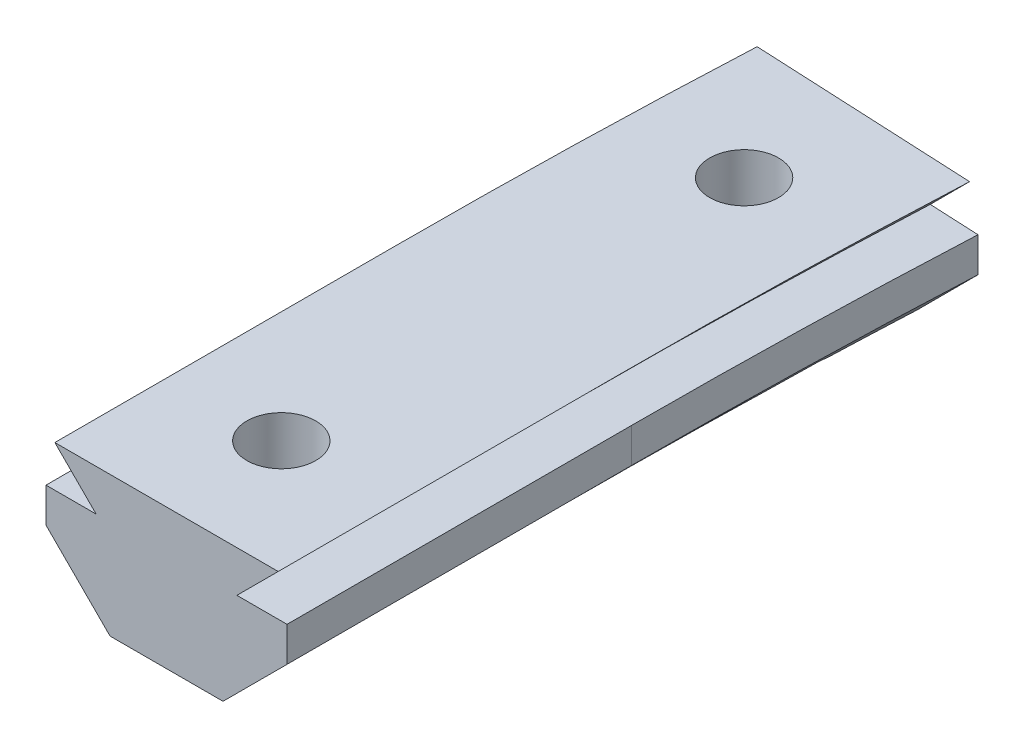
ISO-10303-21;
HEADER;
FILE_DESCRIPTION(('STEP AP214'),'2;1');
FILE_NAME('part.step','',(''),(''),'','','');
FILE_SCHEMA(('AUTOMOTIVE_DESIGN { 1 0 10303 214 1 1 1 1 }'));
ENDSEC;
DATA;
#1=APPLICATION_CONTEXT('core data for automotive mechanical design processes');
#2=APPLICATION_PROTOCOL_DEFINITION('international standard','automotive_design',2000,#1);
#3=PRODUCT_CONTEXT('',#1,'mechanical');
#4=PRODUCT('Part','Part','',(#3));
#5=PRODUCT_RELATED_PRODUCT_CATEGORY('part','',(#4));
#6=PRODUCT_DEFINITION_FORMATION('','',#4);
#7=PRODUCT_DEFINITION_CONTEXT('part definition',#1,'design');
#8=PRODUCT_DEFINITION('design','',#6,#7);
#9=PRODUCT_DEFINITION_SHAPE('','',#8);
#10=(LENGTH_UNIT() NAMED_UNIT(*) SI_UNIT(.MILLI.,.METRE.));
#11=(NAMED_UNIT(*) PLANE_ANGLE_UNIT() SI_UNIT($,.RADIAN.));
#12=(NAMED_UNIT(*) SI_UNIT($,.STERADIAN.) SOLID_ANGLE_UNIT());
#13=UNCERTAINTY_MEASURE_WITH_UNIT(LENGTH_MEASURE(1.E-05),#10,'distance_accuracy_value','');
#14=(GEOMETRIC_REPRESENTATION_CONTEXT(3) GLOBAL_UNCERTAINTY_ASSIGNED_CONTEXT((#13)) GLOBAL_UNIT_ASSIGNED_CONTEXT((#10,
#11,#12)) REPRESENTATION_CONTEXT('',''));
#15=CARTESIAN_POINT('',(0.,0.,0.));
#16=DIRECTION('',(0.,0.,1.));
#17=DIRECTION('',(1.,0.,0.));
#18=AXIS2_PLACEMENT_3D('',#15,#16,#17);
#19=CARTESIAN_POINT('',(0.,-6.69603261727048E-13,10.));
#20=DIRECTION('',(0.,1.,0.));
#21=DIRECTION('',(-1.,0.,0.));
#22=AXIS2_PLACEMENT_3D('',#19,#20,#21);
#23=CYLINDRICAL_SURFACE('',#22,1.5);
#24=CARTESIAN_POINT('',(0.,6.1,10.));
#25=DIRECTION('',(0.,1.,0.));
#26=DIRECTION('',(-1.,0.,0.));
#27=AXIS2_PLACEMENT_3D('',#24,#25,#26);
#28=CIRCLE('',#27,1.5);
#29=CARTESIAN_POINT('',(-1.49999999999999,6.1,10.));
#30=VERTEX_POINT('',#29);
#31=EDGE_CURVE('E535',#30,#30,#28,.T.);
#32=ORIENTED_EDGE('',*,*,#31,.T.);
#33=EDGE_LOOP('',(#32));
#34=FACE_BOUND('',#33,.T.);
#35=CARTESIAN_POINT('',(0.,3.,10.));
#36=DIRECTION('',(0.,-1.,0.));
#37=DIRECTION('',(1.,0.,0.));
#38=AXIS2_PLACEMENT_3D('',#35,#36,#37);
#39=CIRCLE('',#38,1.5);
#40=CARTESIAN_POINT('',(1.5,3.,10.));
#41=VERTEX_POINT('',#40);
#42=EDGE_CURVE('E42',#41,#41,#39,.F.);
#43=ORIENTED_EDGE('',*,*,#42,.F.);
#44=EDGE_LOOP('',(#43));
#45=FACE_BOUND('',#44,.T.);
#46=ADVANCED_FACE('F38',(#34,#45),#23,.F.);
#47=CARTESIAN_POINT('',(0.159022715777613,-6.69603261727048E-13,-10.));
#48=DIRECTION('',(0.,1.,0.));
#49=DIRECTION('',(-1.,0.,0.));
#50=AXIS2_PLACEMENT_3D('',#47,#48,#49);
#51=CYLINDRICAL_SURFACE('',#50,1.5);
#52=CARTESIAN_POINT('',(0.159022715777619,6.1,-10.));
#53=DIRECTION('',(0.,1.,0.));
#54=DIRECTION('',(-1.,0.,0.));
#55=AXIS2_PLACEMENT_3D('',#52,#53,#54);
#56=CIRCLE('',#55,1.5);
#57=CARTESIAN_POINT('',(-1.34097728422238,6.1,-10.));
#58=VERTEX_POINT('',#57);
#59=EDGE_CURVE('E531',#58,#58,#56,.T.);
#60=ORIENTED_EDGE('',*,*,#59,.T.);
#61=EDGE_LOOP('',(#60));
#62=FACE_BOUND('',#61,.T.);
#63=CARTESIAN_POINT('',(0.159022715777616,3.,-10.));
#64=DIRECTION('',(0.,-1.,0.));
#65=DIRECTION('',(1.,0.,0.));
#66=AXIS2_PLACEMENT_3D('',#63,#64,#65);
#67=CIRCLE('',#66,1.5);
#68=CARTESIAN_POINT('',(1.65902271577762,3.,-10.));
#69=VERTEX_POINT('',#68);
#70=EDGE_CURVE('E426',#69,#69,#67,.F.);
#71=ORIENTED_EDGE('',*,*,#70,.F.);
#72=EDGE_LOOP('',(#71));
#73=FACE_BOUND('',#72,.T.);
#74=ADVANCED_FACE('F629',(#62,#73),#51,.F.);
#75=CARTESIAN_POINT('',(-2.46065352773282,0.,0.));
#76=DIRECTION('',(0.,1.,0.));
#77=DIRECTION('',(-1.,0.,0.));
#78=AXIS2_PLACEMENT_3D('',#75,#76,#77);
#79=PLANE('',#78);
#80=CARTESIAN_POINT('',(314.5,-3.30031141304588E-13,0.));
#81=DIRECTION('',(0.,-1.,0.));
#82=DIRECTION('',(-1.,0.,0.));
#83=AXIS2_PLACEMENT_3D('',#80,#81,#82);
#84=CIRCLE('',#83,316.960653527733);
#85=CARTESIAN_POINT('',(-2.46065352773283,0.,0.));
#86=VERTEX_POINT('',#85);
#87=CARTESIAN_POINT('',(-2.3404288469579,0.,-8.72917709771534));
#88=VERTEX_POINT('',#87);
#89=EDGE_CURVE('E609',#86,#88,#84,.T.);
#90=ORIENTED_EDGE('',*,*,#89,.T.);
#91=DIRECTION('',(-0.5,0.,-0.866025403784439));
#92=VECTOR('',#91,1.);
#93=CARTESIAN_POINT('',(-1.45755803795334,0.,-7.2));
#94=LINE('',#93,#92);
#95=CARTESIAN_POINT('',(-1.45755803795334,0.,-7.2));
#96=VERTEX_POINT('',#95);
#97=EDGE_CURVE('E290',#96,#88,#94,.T.);
#98=ORIENTED_EDGE('',*,*,#97,.F.);
#99=DIRECTION('',(-1.,0.,0.));
#100=VECTOR('',#99,1.);
#101=CARTESIAN_POINT('',(1.77560346950857,0.,-7.2));
#102=LINE('',#101,#100);
#103=CARTESIAN_POINT('',(1.77560346950857,0.,-7.2));
#104=VERTEX_POINT('',#103);
#105=EDGE_CURVE('E272',#104,#96,#102,.T.);
#106=ORIENTED_EDGE('',*,*,#105,.F.);
#107=DIRECTION('',(0.5,0.,-0.866025403784439));
#108=VECTOR('',#107,1.);
#109=CARTESIAN_POINT('',(-2.40115223342576,0.,0.0343530882853131));
#110=LINE('',#109,#108);
#111=CARTESIAN_POINT('',(2.57895080141731,0.,-8.59143839499084));
#112=VERTEX_POINT('',#111);
#113=EDGE_CURVE('E11',#104,#112,#110,.T.);
#114=ORIENTED_EDGE('',*,*,#113,.T.);
#115=CARTESIAN_POINT('',(314.5,-3.23959609138669E-13,0.));
#116=DIRECTION('',(0.,-1.,0.));
#117=DIRECTION('',(-1.,0.,0.));
#118=AXIS2_PLACEMENT_3D('',#115,#116,#117);
#119=CIRCLE('',#118,312.039346472267);
#120=CARTESIAN_POINT('',(2.46065352773283,0.,0.));
#121=VERTEX_POINT('',#120);
#122=EDGE_CURVE('E438',#121,#112,#119,.T.);
#123=ORIENTED_EDGE('',*,*,#122,.F.);
#124=DIRECTION('',(0.,0.,-1.));
#125=VECTOR('',#124,1.);
#126=CARTESIAN_POINT('',(2.46065352773283,0.,15.));
#127=LINE('',#126,#125);
#128=CARTESIAN_POINT('',(2.46065352773282,0.,8.66197692985684));
#129=VERTEX_POINT('',#128);
#130=EDGE_CURVE('E495',#129,#121,#127,.T.);
#131=ORIENTED_EDGE('',*,*,#130,.F.);
#132=DIRECTION('',(0.5,0.,0.866025403784439));
#133=VECTOR('',#132,1.);
#134=CARTESIAN_POINT('',(1.61658075373095,0.,7.2));
#135=LINE('',#134,#133);
#136=CARTESIAN_POINT('',(1.61658075373095,0.,7.2));
#137=VERTEX_POINT('',#136);
#138=EDGE_CURVE('E349',#137,#129,#135,.T.);
#139=ORIENTED_EDGE('',*,*,#138,.F.);
#140=DIRECTION('',(1.,0.,0.));
#141=VECTOR('',#140,1.);
#142=CARTESIAN_POINT('',(-1.61658075373095,0.,7.2));
#143=LINE('',#142,#141);
#144=CARTESIAN_POINT('',(-1.61658075373095,0.,7.2));
#145=VERTEX_POINT('',#144);
#146=EDGE_CURVE('E345',#145,#137,#143,.T.);
#147=ORIENTED_EDGE('',*,*,#146,.F.);
#148=DIRECTION('',(-0.5,0.,0.866025403784439));
#149=VECTOR('',#148,1.);
#150=CARTESIAN_POINT('',(1.29009250639256,0.,2.16549423246421));
#151=LINE('',#150,#149);
#152=CARTESIAN_POINT('',(-2.46065352773283,0.,8.66197692985686));
#153=VERTEX_POINT('',#152);
#154=EDGE_CURVE('E539',#145,#153,#151,.T.);
#155=ORIENTED_EDGE('',*,*,#154,.T.);
#156=DIRECTION('',(0.,0.,-1.));
#157=VECTOR('',#156,1.);
#158=CARTESIAN_POINT('',(-2.46065352773282,0.,15.));
#159=LINE('',#158,#157);
#160=EDGE_CURVE('E490',#153,#86,#159,.T.);
#161=ORIENTED_EDGE('',*,*,#160,.T.);
#162=EDGE_LOOP('',(#90,#98,#106,#114,#123,#131,#139,#147,#155,#161));
#163=FACE_BOUND('',#162,.T.);
#164=ADVANCED_FACE('F636',(#163),#79,.F.);
#165=CARTESIAN_POINT('',(-2.46065352773282,0.,15.));
#166=VERTEX_POINT('',#165);
#167=CARTESIAN_POINT('',(-2.46065352773284,0.,11.3380230701431));
#168=VERTEX_POINT('',#167);
#169=EDGE_CURVE('E491',#166,#168,#159,.T.);
#170=ORIENTED_EDGE('',*,*,#169,.T.);
#171=DIRECTION('',(-0.5,0.,-0.866025403784439));
#172=VECTOR('',#171,1.);
#173=CARTESIAN_POINT('',(-1.61658075373095,0.,12.8));
#174=LINE('',#173,#172);
#175=CARTESIAN_POINT('',(-1.61658075373095,0.,12.8));
#176=VERTEX_POINT('',#175);
#177=EDGE_CURVE('E342',#176,#168,#174,.T.);
#178=ORIENTED_EDGE('',*,*,#177,.F.);
#179=DIRECTION('',(-1.,0.,0.));
#180=VECTOR('',#179,1.);
#181=CARTESIAN_POINT('',(1.61658075373095,0.,12.8));
#182=LINE('',#181,#180);
#183=CARTESIAN_POINT('',(1.61658075373095,0.,12.8));
#184=VERTEX_POINT('',#183);
#185=EDGE_CURVE('E321',#184,#176,#182,.T.);
#186=ORIENTED_EDGE('',*,*,#185,.F.);
#187=DIRECTION('',(0.5,0.,-0.866025403784439));
#188=VECTOR('',#187,1.);
#189=CARTESIAN_POINT('',(6.13983476758542,0.,4.96549423246421));
#190=LINE('',#189,#188);
#191=CARTESIAN_POINT('',(2.46065352773282,0.,11.3380230701432));
#192=VERTEX_POINT('',#191);
#193=EDGE_CURVE('E615',#184,#192,#190,.T.);
#194=ORIENTED_EDGE('',*,*,#193,.T.);
#195=CARTESIAN_POINT('',(2.46065352773283,0.,15.));
#196=VERTEX_POINT('',#195);
#197=EDGE_CURVE('E496',#196,#192,#127,.T.);
#198=ORIENTED_EDGE('',*,*,#197,.F.);
#199=DIRECTION('',(1.,0.,0.));
#200=VECTOR('',#199,1.);
#201=CARTESIAN_POINT('',(-2.46065352773282,0.,15.));
#202=LINE('',#201,#200);
#203=EDGE_CURVE('E500',#166,#196,#202,.T.);
#204=ORIENTED_EDGE('',*,*,#203,.F.);
#205=EDGE_LOOP('',(#170,#178,#186,#194,#198,#204));
#206=FACE_BOUND('',#205,.T.);
#207=ADVANCED_FACE('F644',(#206),#79,.F.);
#208=CARTESIAN_POINT('',(0.715059629038089,0.,-14.9791502782834));
#209=DIRECTION('',(0.0476826962324272,0.,-0.998862533324785));
#210=DIRECTION('',(-0.998862533324785,0.,-0.0476826962324272));
#211=AXIS2_PLACEMENT_3D('',#208,#209,#210);
#212=PLANE('',#211);
#213=DIRECTION('',(0.,-1.,0.));
#214=VECTOR('',#213,1.);
#215=CARTESIAN_POINT('',(5.60176156931036,2.78934647226714,-14.7458738098781));
#216=LINE('',#215,#214);
#217=CARTESIAN_POINT('',(5.60176156931036,4.3,-14.7458738098781));
#218=VERTEX_POINT('',#217);
#219=CARTESIAN_POINT('',(5.60176156931042,2.78934647226715,-14.7458738098781));
#220=VERTEX_POINT('',#219);
#221=EDGE_CURVE('E572',#218,#220,#216,.T.);
#222=ORIENTED_EDGE('',*,*,#221,.T.);
#223=DIRECTION('',(0.706302470787129,0.707106781186548,0.0337167578512075));
#224=VECTOR('',#223,1.);
#225=CARTESIAN_POINT('',(314.5,312.039346472268,0.));
#226=LINE('',#225,#224);
#227=CARTESIAN_POINT('',(2.81558788570102,0.,-14.8788773704022));
#228=VERTEX_POINT('',#227);
#229=EDGE_CURVE('E576',#220,#228,#226,.F.);
#230=ORIENTED_EDGE('',*,*,#229,.T.);
#231=DIRECTION('',(-0.998862533324785,0.,-0.0476826962324272));
#232=VECTOR('',#231,1.);
#233=CARTESIAN_POINT('',(-1.73999925958907,0.,-15.0963474133381));
#234=LINE('',#233,#232);
#235=CARTESIAN_POINT('',(-2.10012134699056,0.,-15.1135385597945));
#236=VERTEX_POINT('',#235);
#237=EDGE_CURVE('E540',#228,#236,#234,.T.);
#238=ORIENTED_EDGE('',*,*,#237,.T.);
#239=DIRECTION('',(-0.706302470787128,0.707106781186549,-0.0337167578512075));
#240=VECTOR('',#239,1.);
#241=CARTESIAN_POINT('',(314.5,-316.960653527733,0.));
#242=LINE('',#241,#240);
#243=CARTESIAN_POINT('',(-4.88629503059984,2.78934647226714,-15.2465421203186));
#244=VERTEX_POINT('',#243);
#245=EDGE_CURVE('E544',#236,#244,#242,.T.);
#246=ORIENTED_EDGE('',*,*,#245,.T.);
#247=DIRECTION('',(0.,-1.,0.));
#248=VECTOR('',#247,1.);
#249=CARTESIAN_POINT('',(-4.88629503059984,2.78934647226715,-15.2465421203186));
#250=LINE('',#249,#248);
#251=CARTESIAN_POINT('',(-4.88629503059979,4.3,-15.2465421203186));
#252=VERTEX_POINT('',#251);
#253=EDGE_CURVE('E548',#244,#252,#250,.F.);
#254=ORIENTED_EDGE('',*,*,#253,.T.);
#255=DIRECTION('',(0.998862533324785,0.,0.0476826962324272));
#256=VECTOR('',#255,1.);
#257=CARTESIAN_POINT('',(-4.52300376348194,4.3,-15.2291996867444));
#258=LINE('',#257,#256);
#259=CARTESIAN_POINT('',(-2.70378039528518,4.3,-15.1423554290507));
#260=VERTEX_POINT('',#259);
#261=EDGE_CURVE('E552',#252,#260,#258,.T.);
#262=ORIENTED_EDGE('',*,*,#261,.T.);
#263=DIRECTION('',(-0.706302470787134,0.707106781186543,-0.0337167578512078));
#264=VECTOR('',#263,1.);
#265=CARTESIAN_POINT('',(314.5,-313.264999999995,0.));
#266=LINE('',#265,#264);
#267=CARTESIAN_POINT('',(-4.50173295526979,6.1,-15.2281842822691));
#268=VERTEX_POINT('',#267);
#269=EDGE_CURVE('E556',#260,#268,#266,.T.);
#270=ORIENTED_EDGE('',*,*,#269,.T.);
#271=DIRECTION('',(0.998862533324785,0.,0.0476826962324272));
#272=VECTOR('',#271,1.);
#273=CARTESIAN_POINT('',(5.56899837277334,6.09999999999999,-14.7474378264429));
#274=LINE('',#273,#272);
#275=CARTESIAN_POINT('',(5.21719949398031,6.1,-14.7642316479276));
#276=VERTEX_POINT('',#275);
#277=EDGE_CURVE('E560',#268,#276,#274,.T.);
#278=ORIENTED_EDGE('',*,*,#277,.T.);
#279=DIRECTION('',(0.706302470787134,0.707106781186543,0.0337167578512077));
#280=VECTOR('',#279,1.);
#281=CARTESIAN_POINT('',(314.5,315.734999999996,0.));
#282=LINE('',#281,#280);
#283=CARTESIAN_POINT('',(3.4192469339957,4.3,-14.8500605011459));
#284=VERTEX_POINT('',#283);
#285=EDGE_CURVE('E564',#276,#284,#282,.F.);
#286=ORIENTED_EDGE('',*,*,#285,.T.);
#287=DIRECTION('',(0.998862533324785,0.,0.0476826962324272));
#288=VECTOR('',#287,1.);
#289=CARTESIAN_POINT('',(5.95312302155812,4.3,-14.7291008698224));
#290=LINE('',#289,#288);
#291=EDGE_CURVE('E568',#284,#218,#290,.T.);
#292=ORIENTED_EDGE('',*,*,#291,.T.);
#293=EDGE_LOOP('',(#222,#230,#238,#246,#254,#262,#270,#278,#286,#292));
#294=FACE_BOUND('',#293,.T.);
#295=ADVANCED_FACE('F641',(#294),#212,.T.);
#296=CARTESIAN_POINT('',(314.5,2.78934647226682,0.));
#297=DIRECTION('',(0.,-1.,0.));
#298=DIRECTION('',(1.,0.,0.));
#299=AXIS2_PLACEMENT_3D('',#296,#297,#298);
#300=CYLINDRICAL_SURFACE('',#299,309.25);
#301=ORIENTED_EDGE('',*,*,#221,.F.);
#302=CARTESIAN_POINT('',(314.5,4.29999999999967,0.));
#303=DIRECTION('',(0.,-1.,0.));
#304=DIRECTION('',(-1.,0.,0.));
#305=AXIS2_PLACEMENT_3D('',#302,#303,#304);
#306=CIRCLE('',#305,309.25);
#307=CARTESIAN_POINT('',(5.24999999999999,4.3,0.));
#308=VERTEX_POINT('',#307);
#309=EDGE_CURVE('E588',#308,#218,#306,.T.);
#310=ORIENTED_EDGE('',*,*,#309,.F.);
#311=DIRECTION('',(0.,1.,0.));
#312=VECTOR('',#311,1.);
#313=CARTESIAN_POINT('',(5.25,2.78934647226715,0.));
#314=LINE('',#313,#312);
#315=CARTESIAN_POINT('',(5.24999999999999,2.78934647226715,0.));
#316=VERTEX_POINT('',#315);
#317=EDGE_CURVE('E450',#316,#308,#314,.T.);
#318=ORIENTED_EDGE('',*,*,#317,.F.);
#319=CARTESIAN_POINT('',(314.5,2.78934647226682,0.));
#320=DIRECTION('',(0.,-1.,0.));
#321=DIRECTION('',(-1.,0.,0.));
#322=AXIS2_PLACEMENT_3D('',#319,#320,#321);
#323=CIRCLE('',#322,309.25);
#324=EDGE_CURVE('E585',#316,#220,#323,.T.);
#325=ORIENTED_EDGE('',*,*,#324,.T.);
#326=EDGE_LOOP('',(#301,#310,#318,#325));
#327=FACE_BOUND('',#326,.T.);
#328=ADVANCED_FACE('F643',(#327),#300,.F.);
#329=CARTESIAN_POINT('',(5.25,2.78934647226715,15.));
#330=DIRECTION('',(-1.,0.,0.));
#331=DIRECTION('',(0.,0.,1.));
#332=AXIS2_PLACEMENT_3D('',#329,#330,#331);
#333=PLANE('',#332);
#334=ORIENTED_EDGE('',*,*,#317,.T.);
#335=DIRECTION('',(0.,0.,-1.));
#336=VECTOR('',#335,1.);
#337=CARTESIAN_POINT('',(5.25,4.3,15.));
#338=LINE('',#337,#336);
#339=CARTESIAN_POINT('',(5.25,4.3,15.));
#340=VERTEX_POINT('',#339);
#341=EDGE_CURVE('E462',#340,#308,#338,.T.);
#342=ORIENTED_EDGE('',*,*,#341,.F.);
#343=DIRECTION('',(0.,1.,0.));
#344=VECTOR('',#343,1.);
#345=CARTESIAN_POINT('',(5.25,2.78934647226715,15.));
#346=LINE('',#345,#344);
#347=CARTESIAN_POINT('',(5.25,2.78934647226715,15.));
#348=VERTEX_POINT('',#347);
#349=EDGE_CURVE('E524',#348,#340,#346,.T.);
#350=ORIENTED_EDGE('',*,*,#349,.F.);
#351=DIRECTION('',(0.,0.,-1.));
#352=VECTOR('',#351,1.);
#353=CARTESIAN_POINT('',(5.25,2.78934647226715,15.));
#354=LINE('',#353,#352);
#355=EDGE_CURVE('E458',#348,#316,#354,.T.);
#356=ORIENTED_EDGE('',*,*,#355,.T.);
#357=EDGE_LOOP('',(#334,#342,#350,#356));
#358=FACE_BOUND('',#357,.T.);
#359=ADVANCED_FACE('F655',(#358),#333,.F.);
#360=CARTESIAN_POINT('',(5.25,4.3,0.));
#361=DIRECTION('',(0.,-1.,0.));
#362=DIRECTION('',(1.,0.,0.));
#363=AXIS2_PLACEMENT_3D('',#360,#361,#362);
#364=PLANE('',#363);
#365=ORIENTED_EDGE('',*,*,#291,.F.);
#366=CARTESIAN_POINT('',(314.5,4.29999999999967,0.));
#367=DIRECTION('',(0.,-1.,0.));
#368=DIRECTION('',(-1.,0.,0.));
#369=AXIS2_PLACEMENT_3D('',#366,#367,#368);
#370=CIRCLE('',#369,311.435);
#371=CARTESIAN_POINT('',(3.06499999999999,4.3,0.));
#372=VERTEX_POINT('',#371);
#373=EDGE_CURVE('E591',#372,#284,#370,.T.);
#374=ORIENTED_EDGE('',*,*,#373,.F.);
#375=DIRECTION('',(0.,0.,-1.));
#376=VECTOR('',#375,1.);
#377=CARTESIAN_POINT('',(3.065,4.3,15.));
#378=LINE('',#377,#376);
#379=CARTESIAN_POINT('',(3.065,4.3,15.));
#380=VERTEX_POINT('',#379);
#381=EDGE_CURVE('E466',#380,#372,#378,.T.);
#382=ORIENTED_EDGE('',*,*,#381,.F.);
#383=DIRECTION('',(-1.,0.,0.));
#384=VECTOR('',#383,1.);
#385=CARTESIAN_POINT('',(5.25,4.3,15.));
#386=LINE('',#385,#384);
#387=EDGE_CURVE('E521',#340,#380,#386,.T.);
#388=ORIENTED_EDGE('',*,*,#387,.F.);
#389=ORIENTED_EDGE('',*,*,#341,.T.);
#390=ORIENTED_EDGE('',*,*,#309,.T.);
#391=EDGE_LOOP('',(#365,#374,#382,#388,#389,#390));
#392=FACE_BOUND('',#391,.T.);
#393=ADVANCED_FACE('F657',(#392),#364,.F.);
#394=CARTESIAN_POINT('',(314.5,4.29999999999967,0.));
#395=DIRECTION('',(0.,-1.,0.));
#396=DIRECTION('',(1.,0.,0.));
#397=AXIS2_PLACEMENT_3D('',#394,#395,#396);
#398=CONICAL_SURFACE('',#397,311.435,0.785398163397454);
#399=ORIENTED_EDGE('',*,*,#285,.F.);
#400=CARTESIAN_POINT('',(314.5,6.09999999999968,0.));
#401=DIRECTION('',(0.,-1.,0.));
#402=DIRECTION('',(-1.,0.,0.));
#403=AXIS2_PLACEMENT_3D('',#400,#401,#402);
#404=CIRCLE('',#403,309.635);
#405=CARTESIAN_POINT('',(4.86500000000001,6.1,0.));
#406=VERTEX_POINT('',#405);
#407=EDGE_CURVE('E594',#406,#276,#404,.T.);
#408=ORIENTED_EDGE('',*,*,#407,.F.);
#409=DIRECTION('',(0.70710678118655,0.707106781186545,0.));
#410=VECTOR('',#409,1.);
#411=CARTESIAN_POINT('',(3.065,4.3,0.));
#412=LINE('',#411,#410);
#413=EDGE_CURVE('E446',#372,#406,#412,.T.);
#414=ORIENTED_EDGE('',*,*,#413,.F.);
#415=ORIENTED_EDGE('',*,*,#373,.T.);
#416=EDGE_LOOP('',(#399,#408,#414,#415));
#417=FACE_BOUND('',#416,.T.);
#418=ADVANCED_FACE('F660',(#417),#398,.F.);
#419=CARTESIAN_POINT('',(3.065,4.3,15.));
#420=DIRECTION('',(-0.707106781186545,0.70710678118655,0.));
#421=DIRECTION('',(-0.70710678118655,-0.707106781186545,0.));
#422=AXIS2_PLACEMENT_3D('',#419,#420,#421);
#423=PLANE('',#422);
#424=ORIENTED_EDGE('',*,*,#413,.T.);
#425=DIRECTION('',(0.,0.,-1.));
#426=VECTOR('',#425,1.);
#427=CARTESIAN_POINT('',(4.86500000000002,6.1,15.));
#428=LINE('',#427,#426);
#429=CARTESIAN_POINT('',(4.86500000000002,6.1,15.));
#430=VERTEX_POINT('',#429);
#431=EDGE_CURVE('E470',#430,#406,#428,.T.);
#432=ORIENTED_EDGE('',*,*,#431,.F.);
#433=DIRECTION('',(0.70710678118655,0.707106781186545,0.));
#434=VECTOR('',#433,1.);
#435=CARTESIAN_POINT('',(3.065,4.3,15.));
#436=LINE('',#435,#434);
#437=EDGE_CURVE('E518',#380,#430,#436,.T.);
#438=ORIENTED_EDGE('',*,*,#437,.F.);
#439=ORIENTED_EDGE('',*,*,#381,.T.);
#440=EDGE_LOOP('',(#424,#432,#438,#439));
#441=FACE_BOUND('',#440,.T.);
#442=ADVANCED_FACE('F664',(#441),#423,.F.);
#443=CARTESIAN_POINT('',(4.86500000000002,6.09999999999999,0.));
#444=DIRECTION('',(0.,-1.,0.));
#445=DIRECTION('',(1.,0.,0.));
#446=AXIS2_PLACEMENT_3D('',#443,#444,#445);
#447=PLANE('',#446);
#448=ORIENTED_EDGE('',*,*,#59,.F.);
#449=EDGE_LOOP('',(#448));
#450=FACE_BOUND('',#449,.T.);
#451=ORIENTED_EDGE('',*,*,#31,.F.);
#452=EDGE_LOOP('',(#451));
#453=FACE_BOUND('',#452,.T.);
#454=ORIENTED_EDGE('',*,*,#277,.F.);
#455=CARTESIAN_POINT('',(314.5,6.09999999999966,0.));
#456=DIRECTION('',(0.,-1.,0.));
#457=DIRECTION('',(-1.,0.,0.));
#458=AXIS2_PLACEMENT_3D('',#455,#456,#457);
#459=CIRCLE('',#458,319.365);
#460=CARTESIAN_POINT('',(-4.86500000000001,6.1,0.));
#461=VERTEX_POINT('',#460);
#462=EDGE_CURVE('E597',#461,#268,#459,.T.);
#463=ORIENTED_EDGE('',*,*,#462,.F.);
#464=DIRECTION('',(0.,0.,-1.));
#465=VECTOR('',#464,1.);
#466=CARTESIAN_POINT('',(-4.86500000000002,6.1,15.));
#467=LINE('',#466,#465);
#468=CARTESIAN_POINT('',(-4.86500000000002,6.1,15.));
#469=VERTEX_POINT('',#468);
#470=EDGE_CURVE('E474',#469,#461,#467,.T.);
#471=ORIENTED_EDGE('',*,*,#470,.F.);
#472=DIRECTION('',(-1.,0.,0.));
#473=VECTOR('',#472,1.);
#474=CARTESIAN_POINT('',(4.86500000000002,6.1,15.));
#475=LINE('',#474,#473);
#476=EDGE_CURVE('E515',#430,#469,#475,.T.);
#477=ORIENTED_EDGE('',*,*,#476,.F.);
#478=ORIENTED_EDGE('',*,*,#431,.T.);
#479=ORIENTED_EDGE('',*,*,#407,.T.);
#480=EDGE_LOOP('',(#454,#463,#471,#477,#478,#479));
#481=FACE_BOUND('',#480,.T.);
#482=ADVANCED_FACE('F666',(#450,#453,#481),#447,.F.);
#483=CARTESIAN_POINT('',(314.5,6.09999999999966,0.));
#484=DIRECTION('',(0.,1.,0.));
#485=DIRECTION('',(-1.,0.,0.));
#486=AXIS2_PLACEMENT_3D('',#483,#484,#485);
#487=CONICAL_SURFACE('',#486,319.365,0.785398163397456);
#488=ORIENTED_EDGE('',*,*,#269,.F.);
#489=CARTESIAN_POINT('',(314.5,4.29999999999967,0.));
#490=DIRECTION('',(0.,-1.,0.));
#491=DIRECTION('',(-1.,0.,0.));
#492=AXIS2_PLACEMENT_3D('',#489,#490,#491);
#493=CIRCLE('',#492,317.565);
#494=CARTESIAN_POINT('',(-3.06499999999999,4.3,0.));
#495=VERTEX_POINT('',#494);
#496=EDGE_CURVE('E600',#495,#260,#493,.T.);
#497=ORIENTED_EDGE('',*,*,#496,.F.);
#498=DIRECTION('',(0.707106781186551,-0.707106781186544,0.));
#499=VECTOR('',#498,1.);
#500=CARTESIAN_POINT('',(-3.065,4.3,0.));
#501=LINE('',#500,#499);
#502=EDGE_CURVE('E442',#461,#495,#501,.T.);
#503=ORIENTED_EDGE('',*,*,#502,.F.);
#504=ORIENTED_EDGE('',*,*,#462,.T.);
#505=EDGE_LOOP('',(#488,#497,#503,#504));
#506=FACE_BOUND('',#505,.T.);
#507=ADVANCED_FACE('F669',(#506),#487,.T.);
#508=CARTESIAN_POINT('',(-3.065,4.3,15.));
#509=DIRECTION('',(0.707106781186544,0.707106781186551,0.));
#510=DIRECTION('',(-0.707106781186551,0.707106781186544,0.));
#511=AXIS2_PLACEMENT_3D('',#508,#509,#510);
#512=PLANE('',#511);
#513=ORIENTED_EDGE('',*,*,#502,.T.);
#514=DIRECTION('',(0.,0.,-1.));
#515=VECTOR('',#514,1.);
#516=CARTESIAN_POINT('',(-3.065,4.3,15.));
#517=LINE('',#516,#515);
#518=CARTESIAN_POINT('',(-3.065,4.3,15.));
#519=VERTEX_POINT('',#518);
#520=EDGE_CURVE('E478',#519,#495,#517,.T.);
#521=ORIENTED_EDGE('',*,*,#520,.F.);
#522=DIRECTION('',(0.707106781186551,-0.707106781186544,0.));
#523=VECTOR('',#522,1.);
#524=CARTESIAN_POINT('',(-3.065,4.3,15.));
#525=LINE('',#524,#523);
#526=EDGE_CURVE('E512',#469,#519,#525,.T.);
#527=ORIENTED_EDGE('',*,*,#526,.F.);
#528=ORIENTED_EDGE('',*,*,#470,.T.);
#529=EDGE_LOOP('',(#513,#521,#527,#528));
#530=FACE_BOUND('',#529,.T.);
#531=ADVANCED_FACE('F673',(#530),#512,.F.);
#532=CARTESIAN_POINT('',(-5.25,4.3,0.));
#533=DIRECTION('',(0.,-1.,0.));
#534=DIRECTION('',(1.,0.,0.));
#535=AXIS2_PLACEMENT_3D('',#532,#533,#534);
#536=PLANE('',#535);
#537=ORIENTED_EDGE('',*,*,#261,.F.);
#538=CARTESIAN_POINT('',(314.5,4.29999999999966,0.));
#539=DIRECTION('',(0.,-1.,0.));
#540=DIRECTION('',(-1.,0.,0.));
#541=AXIS2_PLACEMENT_3D('',#538,#539,#540);
#542=CIRCLE('',#541,319.75);
#543=CARTESIAN_POINT('',(-5.24999999999999,4.3,0.));
#544=VERTEX_POINT('',#543);
#545=EDGE_CURVE('E603',#544,#252,#542,.T.);
#546=ORIENTED_EDGE('',*,*,#545,.F.);
#547=DIRECTION('',(0.,0.,-1.));
#548=VECTOR('',#547,1.);
#549=CARTESIAN_POINT('',(-5.25,4.3,15.));
#550=LINE('',#549,#548);
#551=CARTESIAN_POINT('',(-5.25,4.3,15.));
#552=VERTEX_POINT('',#551);
#553=EDGE_CURVE('E482',#552,#544,#550,.T.);
#554=ORIENTED_EDGE('',*,*,#553,.F.);
#555=DIRECTION('',(-1.,0.,0.));
#556=VECTOR('',#555,1.);
#557=CARTESIAN_POINT('',(-5.25,4.3,15.));
#558=LINE('',#557,#556);
#559=EDGE_CURVE('E509',#519,#552,#558,.T.);
#560=ORIENTED_EDGE('',*,*,#559,.F.);
#561=ORIENTED_EDGE('',*,*,#520,.T.);
#562=ORIENTED_EDGE('',*,*,#496,.T.);
#563=EDGE_LOOP('',(#537,#546,#554,#560,#561,#562));
#564=FACE_BOUND('',#563,.T.);
#565=ADVANCED_FACE('F675',(#564),#536,.F.);
#566=CARTESIAN_POINT('',(-5.25,2.78934647226715,15.));
#567=DIRECTION('',(1.,0.,0.));
#568=DIRECTION('',(0.,0.,-1.));
#569=AXIS2_PLACEMENT_3D('',#566,#567,#568);
#570=PLANE('',#569);
#571=DIRECTION('',(0.,-1.,0.));
#572=VECTOR('',#571,1.);
#573=CARTESIAN_POINT('',(-5.25,2.78934647226715,0.));
#574=LINE('',#573,#572);
#575=CARTESIAN_POINT('',(-5.24999999999999,2.78934647226715,0.));
#576=VERTEX_POINT('',#575);
#577=EDGE_CURVE('E437',#544,#576,#574,.T.);
#578=ORIENTED_EDGE('',*,*,#577,.T.);
#579=DIRECTION('',(0.,0.,-1.));
#580=VECTOR('',#579,1.);
#581=CARTESIAN_POINT('',(-5.25,2.78934647226715,15.));
#582=LINE('',#581,#580);
#583=CARTESIAN_POINT('',(-5.25,2.78934647226715,15.));
#584=VERTEX_POINT('',#583);
#585=EDGE_CURVE('E486',#584,#576,#582,.T.);
#586=ORIENTED_EDGE('',*,*,#585,.F.);
#587=DIRECTION('',(0.,-1.,0.));
#588=VECTOR('',#587,1.);
#589=CARTESIAN_POINT('',(-5.25,2.78934647226715,15.));
#590=LINE('',#589,#588);
#591=EDGE_CURVE('E506',#552,#584,#590,.T.);
#592=ORIENTED_EDGE('',*,*,#591,.F.);
#593=ORIENTED_EDGE('',*,*,#553,.T.);
#594=EDGE_LOOP('',(#578,#586,#592,#593));
#595=FACE_BOUND('',#594,.T.);
#596=ADVANCED_FACE('F677',(#595),#570,.F.);
#597=CARTESIAN_POINT('',(314.5,2.78934647226682,0.));
#598=DIRECTION('',(0.,-1.,0.));
#599=DIRECTION('',(1.,0.,0.));
#600=AXIS2_PLACEMENT_3D('',#597,#598,#599);
#601=CYLINDRICAL_SURFACE('',#600,319.75);
#602=ORIENTED_EDGE('',*,*,#253,.F.);
#603=CARTESIAN_POINT('',(314.5,2.78934647226681,0.));
#604=DIRECTION('',(0.,-1.,0.));
#605=DIRECTION('',(-1.,0.,0.));
#606=AXIS2_PLACEMENT_3D('',#603,#604,#605);
#607=CIRCLE('',#606,319.75);
#608=EDGE_CURVE('E606',#576,#244,#607,.T.);
#609=ORIENTED_EDGE('',*,*,#608,.F.);
#610=ORIENTED_EDGE('',*,*,#577,.F.);
#611=ORIENTED_EDGE('',*,*,#545,.T.);
#612=EDGE_LOOP('',(#602,#609,#610,#611));
#613=FACE_BOUND('',#612,.T.);
#614=ADVANCED_FACE('F679',(#613),#601,.T.);
#615=CARTESIAN_POINT('',(314.5,2.78934647226681,0.));
#616=DIRECTION('',(0.,1.,0.));
#617=DIRECTION('',(-1.,0.,0.));
#618=AXIS2_PLACEMENT_3D('',#615,#616,#617);
#619=CONICAL_SURFACE('',#618,319.75,0.785398163397448);
#620=CARTESIAN_POINT('',(-2.25468063175474,-0.000200000000000641,-11.4193431676749));
#621=CARTESIAN_POINT('',(-2.39138204875502,0.127883357712931,-11.1825693679637));
#622=CARTESIAN_POINT('',(-2.52803055980997,0.256191613652714,-10.9458872040379));
#623=CARTESIAN_POINT('',(-2.80122176980426,0.513257921774297,-10.4727061481466));
#624=CARTESIAN_POINT('',(-2.93776446874377,0.642015973955357,-10.2362072561808));
#625=CARTESIAN_POINT('',(-3.07425426173812,0.770998924362526,-9.99980000000001));
#626=B_SPLINE_CURVE_WITH_KNOTS('',3,(#620,#621,#622,#623,#624,#625),.UNSPECIFIED.,.F.,.F.,(4,2,
4),(0.,0.905752967164911,1.81150593283812),.UNSPECIFIED.);
#627=CARTESIAN_POINT('',(-2.25489409029246,0.,-11.4189734466424));
#628=VERTEX_POINT('',#627);
#629=CARTESIAN_POINT('',(-3.07413879168429,0.770889806069559,-10.));
#630=VERTEX_POINT('',#629);
#631=EDGE_CURVE('E56',#628,#630,#626,.T.);
#632=ORIENTED_EDGE('',*,*,#631,.T.);
#633=CARTESIAN_POINT('',(-3.07425426173813,0.771011513602154,-10.0002));
#634=CARTESIAN_POINT('',(-2.95200254643584,0.64215514290603,-9.78845381778399));
#635=CARTESIAN_POINT('',(-2.82970865729914,0.513459331457997,-9.57663458834403));
#636=CARTESIAN_POINT('',(-2.58503653122891,0.256388826923602,-9.15285003479449));
#637=CARTESIAN_POINT('',(-2.46265829429529,0.128014133837576,-8.94088471068476));
#638=CARTESIAN_POINT('',(-2.34023788352717,-0.000200000000022991,-8.72884633935093));
#639=B_SPLINE_CURVE_WITH_KNOTS('',3,(#633,#634,#635,#636,#637,#638),.UNSPECIFIED.,.F.,.F.,(4,2,
4),(0.,0.829139396292833,1.65827879345337),.UNSPECIFIED.);
#640=EDGE_CURVE('E252',#630,#88,#639,.T.);
#641=ORIENTED_EDGE('',*,*,#640,.T.);
#642=ORIENTED_EDGE('',*,*,#89,.F.);
#643=DIRECTION('',(0.707106781186552,-0.707106781186543,0.));
#644=VECTOR('',#643,1.);
#645=CARTESIAN_POINT('',(-2.46065352773282,0.,0.));
#646=LINE('',#645,#644);
#647=EDGE_CURVE('E433',#576,#86,#646,.T.);
#648=ORIENTED_EDGE('',*,*,#647,.F.);
#649=ORIENTED_EDGE('',*,*,#608,.T.);
#650=ORIENTED_EDGE('',*,*,#245,.F.);
#651=EDGE_CURVE('E580',#628,#236,#84,.T.);
#652=ORIENTED_EDGE('',*,*,#651,.F.);
#653=EDGE_LOOP('',(#632,#641,#642,#648,#649,#650,#652));
#654=FACE_BOUND('',#653,.T.);
#655=ADVANCED_FACE('F403',(#654),#619,.T.);
#656=CARTESIAN_POINT('',(-2.46065352773282,0.,15.));
#657=DIRECTION('',(0.707106781186543,0.707106781186552,0.));
#658=DIRECTION('',(-0.707106781186552,0.707106781186543,0.));
#659=AXIS2_PLACEMENT_3D('',#656,#657,#658);
#660=PLANE('',#659);
#661=DIRECTION('',(-0.447213595499959,0.447213595499953,0.774596669241485));
#662=VECTOR('',#661,1.);
#663=CARTESIAN_POINT('',(-4.65620912313916,2.19555559540631,12.4647907719428));
#664=LINE('',#663,#662);
#665=CARTESIAN_POINT('',(-3.2331615074619,0.772507979729075,10.));
#666=VERTEX_POINT('',#665);
#667=EDGE_CURVE('E64',#153,#666,#664,.T.);
#668=ORIENTED_EDGE('',*,*,#667,.T.);
#669=DIRECTION('',(0.447213595499959,-0.447213595499953,0.774596669241486));
#670=VECTOR('',#669,1.);
#671=CARTESIAN_POINT('',(-1.19210750800139,-1.26854601973141,13.5352092280573));
#672=LINE('',#671,#670);
#673=EDGE_CURVE('E384',#666,#168,#672,.T.);
#674=ORIENTED_EDGE('',*,*,#673,.T.);
#675=ORIENTED_EDGE('',*,*,#169,.F.);
#676=DIRECTION('',(0.707106781186552,-0.707106781186543,0.));
#677=VECTOR('',#676,1.);
#678=CARTESIAN_POINT('',(-2.46065352773282,0.,15.));
#679=LINE('',#678,#677);
#680=EDGE_CURVE('E503',#584,#166,#679,.T.);
#681=ORIENTED_EDGE('',*,*,#680,.F.);
#682=ORIENTED_EDGE('',*,*,#585,.T.);
#683=ORIENTED_EDGE('',*,*,#647,.T.);
#684=ORIENTED_EDGE('',*,*,#160,.F.);
#685=EDGE_LOOP('',(#668,#674,#675,#681,#682,#683,#684));
#686=FACE_BOUND('',#685,.T.);
#687=ADVANCED_FACE('F687',(#686),#660,.F.);
#688=CARTESIAN_POINT('',(0.,0.,15.));
#689=DIRECTION('',(0.,0.,1.));
#690=DIRECTION('',(1.,0.,0.));
#691=AXIS2_PLACEMENT_3D('',#688,#689,#690);
#692=PLANE('',#691);
#693=DIRECTION('',(0.707106781186552,0.707106781186543,0.));
#694=VECTOR('',#693,1.);
#695=CARTESIAN_POINT('',(2.46065352773283,0.,15.));
#696=LINE('',#695,#694);
#697=EDGE_CURVE('E527',#196,#348,#696,.T.);
#698=ORIENTED_EDGE('',*,*,#697,.T.);
#699=ORIENTED_EDGE('',*,*,#349,.T.);
#700=ORIENTED_EDGE('',*,*,#387,.T.);
#701=ORIENTED_EDGE('',*,*,#437,.T.);
#702=ORIENTED_EDGE('',*,*,#476,.T.);
#703=ORIENTED_EDGE('',*,*,#526,.T.);
#704=ORIENTED_EDGE('',*,*,#559,.T.);
#705=ORIENTED_EDGE('',*,*,#591,.T.);
#706=ORIENTED_EDGE('',*,*,#680,.T.);
#707=ORIENTED_EDGE('',*,*,#203,.T.);
#708=EDGE_LOOP('',(#698,#699,#700,#701,#702,#703,#704,#705,#706,#707));
#709=FACE_BOUND('',#708,.T.);
#710=ADVANCED_FACE('F767',(#709),#692,.T.);
#711=CARTESIAN_POINT('',(2.46065352773283,0.,15.));
#712=DIRECTION('',(-0.707106781186543,0.707106781186552,0.));
#713=DIRECTION('',(-0.707106781186552,-0.707106781186543,0.));
#714=AXIS2_PLACEMENT_3D('',#711,#712,#713);
#715=PLANE('',#714);
#716=ORIENTED_EDGE('',*,*,#197,.T.);
#717=DIRECTION('',(0.447213595499959,0.447213595499954,-0.774596669241485));
#718=VECTOR('',#717,1.);
#719=CARTESIAN_POINT('',(1.19210750800139,-1.26854601973141,13.5352092280573));
#720=LINE('',#719,#718);
#721=CARTESIAN_POINT('',(3.23316150746191,0.77250797972908,10.));
#722=VERTEX_POINT('',#721);
#723=EDGE_CURVE('E380',#192,#722,#720,.T.);
#724=ORIENTED_EDGE('',*,*,#723,.T.);
#725=DIRECTION('',(-0.447213595499959,-0.447213595499954,-0.774596669241485));
#726=VECTOR('',#725,1.);
#727=CARTESIAN_POINT('',(4.65620912313916,2.19555559540632,12.4647907719428));
#728=LINE('',#727,#726);
#729=EDGE_CURVE('E376',#722,#129,#728,.T.);
#730=ORIENTED_EDGE('',*,*,#729,.T.);
#731=ORIENTED_EDGE('',*,*,#130,.T.);
#732=DIRECTION('',(0.707106781186552,0.707106781186543,0.));
#733=VECTOR('',#732,1.);
#734=CARTESIAN_POINT('',(2.46065352773283,0.,0.));
#735=LINE('',#734,#733);
#736=EDGE_CURVE('E454',#121,#316,#735,.T.);
#737=ORIENTED_EDGE('',*,*,#736,.T.);
#738=ORIENTED_EDGE('',*,*,#355,.F.);
#739=ORIENTED_EDGE('',*,*,#697,.F.);
#740=EDGE_LOOP('',(#716,#724,#730,#731,#737,#738,#739));
#741=FACE_BOUND('',#740,.T.);
#742=ADVANCED_FACE('F650',(#741),#715,.F.);
#743=CARTESIAN_POINT('',(314.5,-3.23959609138669E-13,0.));
#744=DIRECTION('',(0.,-1.,0.));
#745=DIRECTION('',(1.,0.,0.));
#746=AXIS2_PLACEMENT_3D('',#743,#744,#745);
#747=CONICAL_SURFACE('',#746,312.039346472267,0.785398163397447);
#748=ORIENTED_EDGE('',*,*,#122,.T.);
#749=CARTESIAN_POINT('',(2.57874070260803,-0.000199999999954718,-8.59107449317856));
#750=CARTESIAN_POINT('',(2.71422765104645,0.128775753181046,-8.82574477163636));
#751=CARTESIAN_POINT('',(2.84976770776543,0.257527395003978,-9.06050703633442));
#752=CARTESIAN_POINT('',(3.1209540379937,0.514582456150905,-9.53021553860792));
#753=CARTESIAN_POINT('',(3.25660031150315,0.642885875474142,-9.76516177618368));
#754=CARTESIAN_POINT('',(3.39229969329336,0.770965183438553,-10.0002));
#755=B_SPLINE_CURVE_WITH_KNOTS('',3,(#749,#750,#751,#752,#753,#754),.UNSPECIFIED.,.F.,.F.,(4,2,
4),(0.,0.900307013503074,1.8006140285276),.UNSPECIFIED.);
#756=CARTESIAN_POINT('',(3.39218422323952,0.770856198377167,-10.));
#757=VERTEX_POINT('',#756);
#758=EDGE_CURVE('E427',#112,#757,#755,.T.);
#759=ORIENTED_EDGE('',*,*,#758,.T.);
#760=CARTESIAN_POINT('',(3.39229969329336,0.770978034085551,-9.9998));
#761=CARTESIAN_POINT('',(3.27078869861813,0.642767633098774,-10.2102632164557));
#762=CARTESIAN_POINT('',(3.14931994744997,0.514397596397148,-10.4206532650109));
#763=CARTESIAN_POINT('',(2.9064669322576,0.257338251701622,-10.8412870260954));
#764=CARTESIAN_POINT('',(2.78508266823331,0.128648943708062,-11.0515307386248));
#765=CARTESIAN_POINT('',(2.66374064771598,-0.000200000000004459,-11.2617012832539));
#766=B_SPLINE_CURVE_WITH_KNOTS('',3,(#760,#761,#762,#763,#764,#765),.UNSPECIFIED.,.F.,.F.,(4,2,
4),(0.,0.82430423223327,1.6486084635852),.UNSPECIFIED.);
#767=CARTESIAN_POINT('',(2.66392899673836,0.,-11.2613750531776));
#768=VERTEX_POINT('',#767);
#769=EDGE_CURVE('E395',#757,#768,#766,.T.);
#770=ORIENTED_EDGE('',*,*,#769,.T.);
#771=EDGE_CURVE('E584',#768,#228,#119,.T.);
#772=ORIENTED_EDGE('',*,*,#771,.T.);
#773=ORIENTED_EDGE('',*,*,#229,.F.);
#774=ORIENTED_EDGE('',*,*,#324,.F.);
#775=ORIENTED_EDGE('',*,*,#736,.F.);
#776=EDGE_LOOP('',(#748,#759,#770,#772,#773,#774,#775));
#777=FACE_BOUND('',#776,.T.);
#778=ADVANCED_FACE('F646',(#777),#747,.F.);
#779=ORIENTED_EDGE('',*,*,#771,.F.);
#780=DIRECTION('',(0.5,0.,0.866025403784439));
#781=VECTOR('',#780,1.);
#782=CARTESIAN_POINT('',(1.77560346950857,0.,-12.8));
#783=LINE('',#782,#781);
#784=CARTESIAN_POINT('',(1.77560346950857,0.,-12.8));
#785=VERTEX_POINT('',#784);
#786=EDGE_CURVE('E276',#785,#768,#783,.T.);
#787=ORIENTED_EDGE('',*,*,#786,.F.);
#788=DIRECTION('',(1.,0.,0.));
#789=VECTOR('',#788,1.);
#790=CARTESIAN_POINT('',(-1.45755803795334,0.,-12.8));
#791=LINE('',#790,#789);
#792=CARTESIAN_POINT('',(-1.45755803795334,0.,-12.8));
#793=VERTEX_POINT('',#792);
#794=EDGE_CURVE('E293',#793,#785,#791,.T.);
#795=ORIENTED_EDGE('',*,*,#794,.F.);
#796=DIRECTION('',(-0.5,0.,0.866025403784439));
#797=VECTOR('',#796,1.);
#798=CARTESIAN_POINT('',(-7.25089449461862,0.,-2.76564691171469));
#799=LINE('',#798,#797);
#800=EDGE_CURVE('E48',#793,#628,#799,.T.);
#801=ORIENTED_EDGE('',*,*,#800,.T.);
#802=ORIENTED_EDGE('',*,*,#651,.T.);
#803=ORIENTED_EDGE('',*,*,#237,.F.);
#804=EDGE_LOOP('',(#779,#787,#795,#801,#802,#803));
#805=FACE_BOUND('',#804,.T.);
#806=ADVANCED_FACE('F40',(#805),#79,.F.);
#807=CARTESIAN_POINT('',(0.,3.,0.));
#808=DIRECTION('',(0.,-1.,0.));
#809=DIRECTION('',(1.,0.,0.));
#810=AXIS2_PLACEMENT_3D('',#807,#808,#809);
#811=PLANE('',#810);
#812=DIRECTION('',(-0.5,0.,-0.866025403784439));
#813=VECTOR('',#812,1.);
#814=CARTESIAN_POINT('',(-1.61658075373095,3.,12.8));
#815=LINE('',#814,#813);
#816=CARTESIAN_POINT('',(-1.61658075373095,3.,12.8));
#817=VERTEX_POINT('',#816);
#818=CARTESIAN_POINT('',(-3.2331615074619,3.,10.));
#819=VERTEX_POINT('',#818);
#820=EDGE_CURVE('E316',#817,#819,#815,.T.);
#821=ORIENTED_EDGE('',*,*,#820,.T.);
#822=DIRECTION('',(0.5,0.,-0.866025403784439));
#823=VECTOR('',#822,1.);
#824=CARTESIAN_POINT('',(-3.2331615074619,3.,10.));
#825=LINE('',#824,#823);
#826=CARTESIAN_POINT('',(-1.61658075373095,3.,7.2));
#827=VERTEX_POINT('',#826);
#828=EDGE_CURVE('E320',#819,#827,#825,.T.);
#829=ORIENTED_EDGE('',*,*,#828,.T.);
#830=DIRECTION('',(1.,0.,0.));
#831=VECTOR('',#830,1.);
#832=CARTESIAN_POINT('',(-1.61658075373095,3.,7.2));
#833=LINE('',#832,#831);
#834=CARTESIAN_POINT('',(1.61658075373096,3.,7.2));
#835=VERTEX_POINT('',#834);
#836=EDGE_CURVE('E325',#827,#835,#833,.T.);
#837=ORIENTED_EDGE('',*,*,#836,.T.);
#838=DIRECTION('',(0.5,0.,0.866025403784439));
#839=VECTOR('',#838,1.);
#840=CARTESIAN_POINT('',(1.61658075373096,3.,7.2));
#841=LINE('',#840,#839);
#842=CARTESIAN_POINT('',(3.23316150746191,3.,10.));
#843=VERTEX_POINT('',#842);
#844=EDGE_CURVE('E329',#835,#843,#841,.T.);
#845=ORIENTED_EDGE('',*,*,#844,.T.);
#846=DIRECTION('',(-0.5,0.,0.866025403784439));
#847=VECTOR('',#846,1.);
#848=CARTESIAN_POINT('',(3.23316150746191,3.,10.));
#849=LINE('',#848,#847);
#850=CARTESIAN_POINT('',(1.61658075373096,3.,12.8));
#851=VERTEX_POINT('',#850);
#852=EDGE_CURVE('E333',#843,#851,#849,.T.);
#853=ORIENTED_EDGE('',*,*,#852,.T.);
#854=DIRECTION('',(-1.,0.,0.));
#855=VECTOR('',#854,1.);
#856=CARTESIAN_POINT('',(1.61658075373096,3.,12.8));
#857=LINE('',#856,#855);
#858=EDGE_CURVE('E337',#851,#817,#857,.T.);
#859=ORIENTED_EDGE('',*,*,#858,.T.);
#860=EDGE_LOOP('',(#821,#829,#837,#845,#853,#859));
#861=FACE_BOUND('',#860,.T.);
#862=ORIENTED_EDGE('',*,*,#42,.T.);
#863=EDGE_LOOP('',(#862));
#864=FACE_BOUND('',#863,.T.);
#865=ADVANCED_FACE('F417',(#861,#864),#811,.T.);
#866=CARTESIAN_POINT('',(-1.61658075373095,3.,12.8));
#867=DIRECTION('',(-0.866025403784439,0.,0.5));
#868=DIRECTION('',(0.5,0.,0.866025403784439));
#869=AXIS2_PLACEMENT_3D('',#866,#867,#868);
#870=PLANE('',#869);
#871=DIRECTION('',(0.,-1.,0.));
#872=VECTOR('',#871,1.);
#873=CARTESIAN_POINT('',(-3.2331615074619,3.,10.));
#874=LINE('',#873,#872);
#875=EDGE_CURVE('E341',#819,#666,#874,.T.);
#876=ORIENTED_EDGE('',*,*,#875,.F.);
#877=ORIENTED_EDGE('',*,*,#820,.F.);
#878=DIRECTION('',(0.,-1.,0.));
#879=VECTOR('',#878,1.);
#880=CARTESIAN_POINT('',(-1.61658075373095,3.,12.8));
#881=LINE('',#880,#879);
#882=EDGE_CURVE('E294',#817,#176,#881,.T.);
#883=ORIENTED_EDGE('',*,*,#882,.T.);
#884=ORIENTED_EDGE('',*,*,#177,.T.);
#885=ORIENTED_EDGE('',*,*,#673,.F.);
#886=EDGE_LOOP('',(#876,#877,#883,#884,#885));
#887=FACE_BOUND('',#886,.T.);
#888=ADVANCED_FACE('F790',(#887),#870,.F.);
#889=CARTESIAN_POINT('',(3.23316150746191,3.,10.));
#890=DIRECTION('',(0.866025403784438,0.,0.5));
#891=DIRECTION('',(0.5,0.,-0.866025403784439));
#892=AXIS2_PLACEMENT_3D('',#889,#890,#891);
#893=PLANE('',#892);
#894=ORIENTED_EDGE('',*,*,#193,.F.);
#895=DIRECTION('',(0.,-1.,0.));
#896=VECTOR('',#895,1.);
#897=CARTESIAN_POINT('',(1.61658075373096,3.,12.8));
#898=LINE('',#897,#896);
#899=EDGE_CURVE('E357',#851,#184,#898,.T.);
#900=ORIENTED_EDGE('',*,*,#899,.F.);
#901=ORIENTED_EDGE('',*,*,#852,.F.);
#902=DIRECTION('',(0.,-1.,0.));
#903=VECTOR('',#902,1.);
#904=CARTESIAN_POINT('',(3.23316150746191,3.,10.));
#905=LINE('',#904,#903);
#906=EDGE_CURVE('E361',#843,#722,#905,.T.);
#907=ORIENTED_EDGE('',*,*,#906,.T.);
#908=ORIENTED_EDGE('',*,*,#723,.F.);
#909=EDGE_LOOP('',(#894,#900,#901,#907,#908));
#910=FACE_BOUND('',#909,.T.);
#911=ADVANCED_FACE('F793',(#910),#893,.F.);
#912=CARTESIAN_POINT('',(1.61658075373096,3.,7.2));
#913=DIRECTION('',(0.866025403784439,0.,-0.5));
#914=DIRECTION('',(-0.5,0.,-0.866025403784439));
#915=AXIS2_PLACEMENT_3D('',#912,#913,#914);
#916=PLANE('',#915);
#917=ORIENTED_EDGE('',*,*,#906,.F.);
#918=ORIENTED_EDGE('',*,*,#844,.F.);
#919=DIRECTION('',(0.,-1.,0.));
#920=VECTOR('',#919,1.);
#921=CARTESIAN_POINT('',(1.61658075373096,3.,7.2));
#922=LINE('',#921,#920);
#923=EDGE_CURVE('E365',#835,#137,#922,.T.);
#924=ORIENTED_EDGE('',*,*,#923,.T.);
#925=ORIENTED_EDGE('',*,*,#138,.T.);
#926=ORIENTED_EDGE('',*,*,#729,.F.);
#927=EDGE_LOOP('',(#917,#918,#924,#925,#926));
#928=FACE_BOUND('',#927,.T.);
#929=ADVANCED_FACE('F797',(#928),#916,.F.);
#930=CARTESIAN_POINT('',(-3.2331615074619,3.,10.));
#931=DIRECTION('',(-0.866025403784439,0.,-0.5));
#932=DIRECTION('',(-0.5,0.,0.866025403784439));
#933=AXIS2_PLACEMENT_3D('',#930,#931,#932);
#934=PLANE('',#933);
#935=ORIENTED_EDGE('',*,*,#154,.F.);
#936=DIRECTION('',(0.,-1.,0.));
#937=VECTOR('',#936,1.);
#938=CARTESIAN_POINT('',(-1.61658075373095,3.,7.2));
#939=LINE('',#938,#937);
#940=EDGE_CURVE('E368',#827,#145,#939,.T.);
#941=ORIENTED_EDGE('',*,*,#940,.F.);
#942=ORIENTED_EDGE('',*,*,#828,.F.);
#943=ORIENTED_EDGE('',*,*,#875,.T.);
#944=ORIENTED_EDGE('',*,*,#667,.F.);
#945=EDGE_LOOP('',(#935,#941,#942,#943,#944));
#946=FACE_BOUND('',#945,.T.);
#947=ADVANCED_FACE('F751',(#946),#934,.F.);
#948=CARTESIAN_POINT('',(1.61658075373096,3.,12.8));
#949=DIRECTION('',(0.,0.,1.));
#950=DIRECTION('',(1.,0.,0.));
#951=AXIS2_PLACEMENT_3D('',#948,#949,#950);
#952=PLANE('',#951);
#953=ORIENTED_EDGE('',*,*,#185,.T.);
#954=ORIENTED_EDGE('',*,*,#882,.F.);
#955=ORIENTED_EDGE('',*,*,#858,.F.);
#956=ORIENTED_EDGE('',*,*,#899,.T.);
#957=EDGE_LOOP('',(#953,#954,#955,#956));
#958=FACE_BOUND('',#957,.T.);
#959=ADVANCED_FACE('F796',(#958),#952,.F.);
#960=CARTESIAN_POINT('',(-1.61658075373095,3.,7.2));
#961=DIRECTION('',(0.,0.,-1.));
#962=DIRECTION('',(-1.,0.,0.));
#963=AXIS2_PLACEMENT_3D('',#960,#961,#962);
#964=PLANE('',#963);
#965=ORIENTED_EDGE('',*,*,#146,.T.);
#966=ORIENTED_EDGE('',*,*,#923,.F.);
#967=ORIENTED_EDGE('',*,*,#836,.F.);
#968=ORIENTED_EDGE('',*,*,#940,.T.);
#969=EDGE_LOOP('',(#965,#966,#967,#968));
#970=FACE_BOUND('',#969,.T.);
#971=ADVANCED_FACE('F755',(#970),#964,.F.);
#972=CARTESIAN_POINT('',(0.,3.,0.));
#973=DIRECTION('',(0.,-1.,0.));
#974=DIRECTION('',(1.,0.,0.));
#975=AXIS2_PLACEMENT_3D('',#972,#973,#974);
#976=PLANE('',#975);
#977=DIRECTION('',(-0.5,0.,-0.866025403784439));
#978=VECTOR('',#977,1.);
#979=CARTESIAN_POINT('',(-1.45755803795334,3.,-7.2));
#980=LINE('',#979,#978);
#981=CARTESIAN_POINT('',(-1.45755803795334,3.,-7.2));
#982=VERTEX_POINT('',#981);
#983=CARTESIAN_POINT('',(-3.07413879168429,3.,-10.));
#984=VERTEX_POINT('',#983);
#985=EDGE_CURVE('E249',#982,#984,#980,.T.);
#986=ORIENTED_EDGE('',*,*,#985,.T.);
#987=DIRECTION('',(0.5,0.,-0.866025403784439));
#988=VECTOR('',#987,1.);
#989=CARTESIAN_POINT('',(-3.07413879168429,3.,-10.));
#990=LINE('',#989,#988);
#991=CARTESIAN_POINT('',(-1.45755803795334,3.,-12.8));
#992=VERTEX_POINT('',#991);
#993=EDGE_CURVE('E258',#984,#992,#990,.T.);
#994=ORIENTED_EDGE('',*,*,#993,.T.);
#995=DIRECTION('',(1.,0.,0.));
#996=VECTOR('',#995,1.);
#997=CARTESIAN_POINT('',(-1.45755803795334,3.,-12.8));
#998=LINE('',#997,#996);
#999=CARTESIAN_POINT('',(1.77560346950857,3.,-12.8));
#1000=VERTEX_POINT('',#999);
#1001=EDGE_CURVE('E265',#992,#1000,#998,.T.);
#1002=ORIENTED_EDGE('',*,*,#1001,.T.);
#1003=DIRECTION('',(0.5,0.,0.866025403784439));
#1004=VECTOR('',#1003,1.);
#1005=CARTESIAN_POINT('',(1.77560346950857,3.,-12.8));
#1006=LINE('',#1005,#1004);
#1007=CARTESIAN_POINT('',(3.39218422323952,3.,-10.));
#1008=VERTEX_POINT('',#1007);
#1009=EDGE_CURVE('E281',#1000,#1008,#1006,.T.);
#1010=ORIENTED_EDGE('',*,*,#1009,.T.);
#1011=DIRECTION('',(-0.5,0.,0.866025403784439));
#1012=VECTOR('',#1011,1.);
#1013=CARTESIAN_POINT('',(3.39218422323952,3.,-10.));
#1014=LINE('',#1013,#1012);
#1015=CARTESIAN_POINT('',(1.77560346950857,3.,-7.2));
#1016=VERTEX_POINT('',#1015);
#1017=EDGE_CURVE('E285',#1008,#1016,#1014,.T.);
#1018=ORIENTED_EDGE('',*,*,#1017,.T.);
#1019=DIRECTION('',(-1.,0.,0.));
#1020=VECTOR('',#1019,1.);
#1021=CARTESIAN_POINT('',(1.77560346950857,3.,-7.2));
#1022=LINE('',#1021,#1020);
#1023=EDGE_CURVE('E255',#1016,#982,#1022,.T.);
#1024=ORIENTED_EDGE('',*,*,#1023,.T.);
#1025=EDGE_LOOP('',(#986,#994,#1002,#1010,#1018,#1024));
#1026=FACE_BOUND('',#1025,.T.);
#1027=ORIENTED_EDGE('',*,*,#70,.T.);
#1028=EDGE_LOOP('',(#1027));
#1029=FACE_BOUND('',#1028,.T.);
#1030=ADVANCED_FACE('F267',(#1026,#1029),#976,.T.);
#1031=CARTESIAN_POINT('',(-1.45755803795334,3.,-7.2));
#1032=DIRECTION('',(-0.866025403784439,0.,0.5));
#1033=DIRECTION('',(0.5,0.,0.866025403784439));
#1034=AXIS2_PLACEMENT_3D('',#1031,#1032,#1033);
#1035=PLANE('',#1034);
#1036=DIRECTION('',(0.,-1.,0.));
#1037=VECTOR('',#1036,1.);
#1038=CARTESIAN_POINT('',(-3.07413879168429,3.,-10.));
#1039=LINE('',#1038,#1037);
#1040=EDGE_CURVE('E245',#984,#630,#1039,.T.);
#1041=ORIENTED_EDGE('',*,*,#1040,.F.);
#1042=ORIENTED_EDGE('',*,*,#985,.F.);
#1043=DIRECTION('',(0.,-1.,0.));
#1044=VECTOR('',#1043,1.);
#1045=CARTESIAN_POINT('',(-1.45755803795334,3.,-7.2));
#1046=LINE('',#1045,#1044);
#1047=EDGE_CURVE('E300',#982,#96,#1046,.T.);
#1048=ORIENTED_EDGE('',*,*,#1047,.T.);
#1049=ORIENTED_EDGE('',*,*,#97,.T.);
#1050=ORIENTED_EDGE('',*,*,#640,.F.);
#1051=EDGE_LOOP('',(#1041,#1042,#1048,#1049,#1050));
#1052=FACE_BOUND('',#1051,.T.);
#1053=ADVANCED_FACE('F247',(#1052),#1035,.F.);
#1054=CARTESIAN_POINT('',(3.39218422323952,3.,-10.));
#1055=DIRECTION('',(0.866025403784439,0.,0.5));
#1056=DIRECTION('',(0.5,0.,-0.866025403784439));
#1057=AXIS2_PLACEMENT_3D('',#1054,#1055,#1056);
#1058=PLANE('',#1057);
#1059=ORIENTED_EDGE('',*,*,#113,.F.);
#1060=DIRECTION('',(0.,-1.,0.));
#1061=VECTOR('',#1060,1.);
#1062=CARTESIAN_POINT('',(1.77560346950857,3.,-7.2));
#1063=LINE('',#1062,#1061);
#1064=EDGE_CURVE('E303',#1016,#104,#1063,.T.);
#1065=ORIENTED_EDGE('',*,*,#1064,.F.);
#1066=ORIENTED_EDGE('',*,*,#1017,.F.);
#1067=DIRECTION('',(0.,-1.,0.));
#1068=VECTOR('',#1067,1.);
#1069=CARTESIAN_POINT('',(3.39218422323952,3.,-10.));
#1070=LINE('',#1069,#1068);
#1071=EDGE_CURVE('E307',#1008,#757,#1070,.T.);
#1072=ORIENTED_EDGE('',*,*,#1071,.T.);
#1073=ORIENTED_EDGE('',*,*,#758,.F.);
#1074=EDGE_LOOP('',(#1059,#1065,#1066,#1072,#1073));
#1075=FACE_BOUND('',#1074,.T.);
#1076=ADVANCED_FACE('F416',(#1075),#1058,.F.);
#1077=CARTESIAN_POINT('',(1.77560346950857,3.,-12.8));
#1078=DIRECTION('',(0.866025403784439,0.,-0.5));
#1079=DIRECTION('',(-0.5,0.,-0.866025403784439));
#1080=AXIS2_PLACEMENT_3D('',#1077,#1078,#1079);
#1081=PLANE('',#1080);
#1082=ORIENTED_EDGE('',*,*,#1071,.F.);
#1083=ORIENTED_EDGE('',*,*,#1009,.F.);
#1084=DIRECTION('',(0.,-1.,0.));
#1085=VECTOR('',#1084,1.);
#1086=CARTESIAN_POINT('',(1.77560346950857,3.,-12.8));
#1087=LINE('',#1086,#1085);
#1088=EDGE_CURVE('E311',#1000,#785,#1087,.T.);
#1089=ORIENTED_EDGE('',*,*,#1088,.T.);
#1090=ORIENTED_EDGE('',*,*,#786,.T.);
#1091=ORIENTED_EDGE('',*,*,#769,.F.);
#1092=EDGE_LOOP('',(#1082,#1083,#1089,#1090,#1091));
#1093=FACE_BOUND('',#1092,.T.);
#1094=ADVANCED_FACE('F411',(#1093),#1081,.F.);
#1095=CARTESIAN_POINT('',(-3.07413879168429,3.,-10.));
#1096=DIRECTION('',(-0.866025403784438,0.,-0.5));
#1097=DIRECTION('',(-0.5,0.,0.866025403784439));
#1098=AXIS2_PLACEMENT_3D('',#1095,#1096,#1097);
#1099=PLANE('',#1098);
#1100=ORIENTED_EDGE('',*,*,#800,.F.);
#1101=DIRECTION('',(0.,-1.,0.));
#1102=VECTOR('',#1101,1.);
#1103=CARTESIAN_POINT('',(-1.45755803795334,3.,-12.8));
#1104=LINE('',#1103,#1102);
#1105=EDGE_CURVE('E254',#992,#793,#1104,.T.);
#1106=ORIENTED_EDGE('',*,*,#1105,.F.);
#1107=ORIENTED_EDGE('',*,*,#993,.F.);
#1108=ORIENTED_EDGE('',*,*,#1040,.T.);
#1109=ORIENTED_EDGE('',*,*,#631,.F.);
#1110=EDGE_LOOP('',(#1100,#1106,#1107,#1108,#1109));
#1111=FACE_BOUND('',#1110,.T.);
#1112=ADVANCED_FACE('F259',(#1111),#1099,.F.);
#1113=CARTESIAN_POINT('',(1.77560346950857,3.,-7.2));
#1114=DIRECTION('',(0.,0.,1.));
#1115=DIRECTION('',(1.,0.,0.));
#1116=AXIS2_PLACEMENT_3D('',#1113,#1114,#1115);
#1117=PLANE('',#1116);
#1118=ORIENTED_EDGE('',*,*,#105,.T.);
#1119=ORIENTED_EDGE('',*,*,#1047,.F.);
#1120=ORIENTED_EDGE('',*,*,#1023,.F.);
#1121=ORIENTED_EDGE('',*,*,#1064,.T.);
#1122=EDGE_LOOP('',(#1118,#1119,#1120,#1121));
#1123=FACE_BOUND('',#1122,.T.);
#1124=ADVANCED_FACE('F410',(#1123),#1117,.F.);
#1125=CARTESIAN_POINT('',(-1.45755803795334,3.,-12.8));
#1126=DIRECTION('',(0.,0.,-1.));
#1127=DIRECTION('',(-1.,0.,0.));
#1128=AXIS2_PLACEMENT_3D('',#1125,#1126,#1127);
#1129=PLANE('',#1128);
#1130=ORIENTED_EDGE('',*,*,#794,.T.);
#1131=ORIENTED_EDGE('',*,*,#1088,.F.);
#1132=ORIENTED_EDGE('',*,*,#1001,.F.);
#1133=ORIENTED_EDGE('',*,*,#1105,.T.);
#1134=EDGE_LOOP('',(#1130,#1131,#1132,#1133));
#1135=FACE_BOUND('',#1134,.T.);
#1136=ADVANCED_FACE('F412',(#1135),#1129,.F.);
#1137=CLOSED_SHELL('',(#46,#74,#164,#207,#295,#328,#359,#393,#418,#442,#482,#507,#531,#565,#596,
#614,#655,#687,#710,#742,#778,#806,#865,#888,#911,#929,#947,#959,#971,#1030,#1053,#1076,#1094,
#1112,#1124,#1136));
#1138=MANIFOLD_SOLID_BREP('B2',#1137);
#1139=ADVANCED_BREP_SHAPE_REPRESENTATION('',(#18,#1138),#14);
#1140=SHAPE_DEFINITION_REPRESENTATION(#9,#1139);
ENDSEC;
END-ISO-10303-21;
